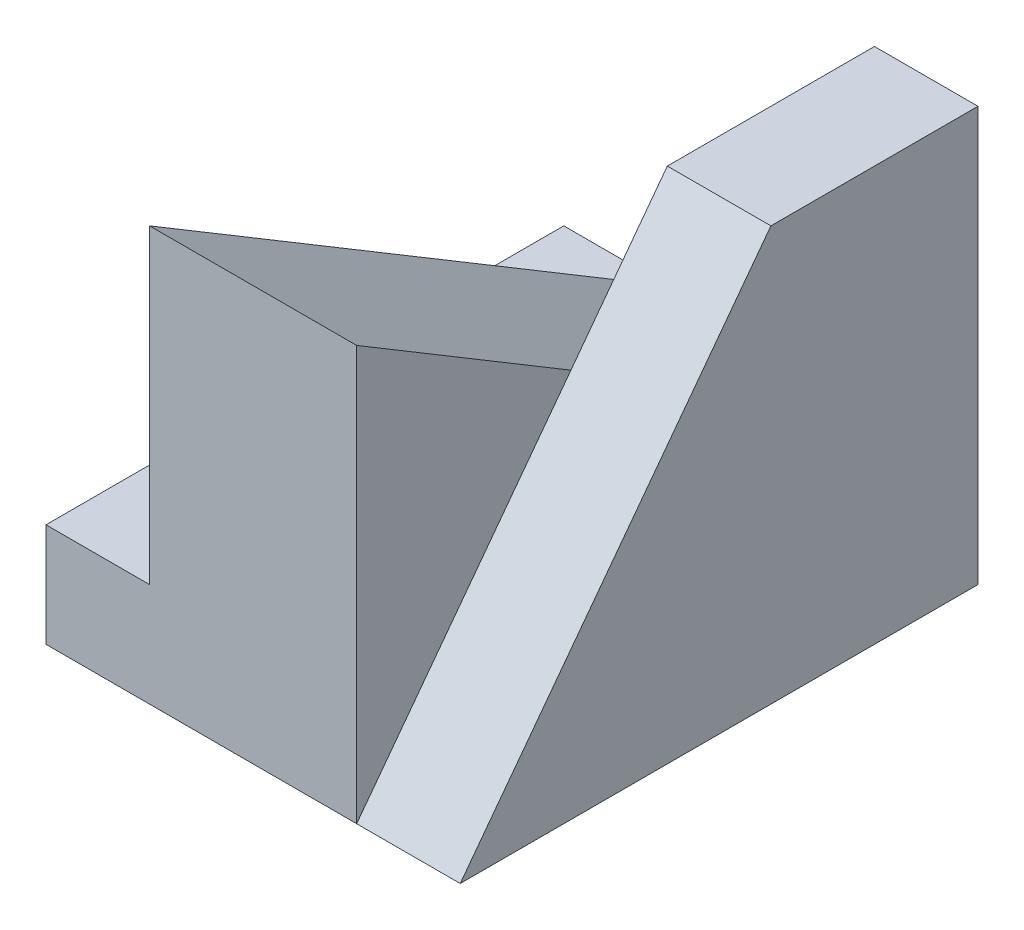
ISO-10303-21;
HEADER;
FILE_DESCRIPTION(('STEP AP214'),'2;1');
FILE_NAME('part.step','',(''),(''),'','','');
FILE_SCHEMA(('AUTOMOTIVE_DESIGN { 1 0 10303 214 1 1 1 1 }'));
ENDSEC;
DATA;
#1=APPLICATION_CONTEXT('core data for automotive mechanical design processes');
#2=APPLICATION_PROTOCOL_DEFINITION('international standard','automotive_design',2000,#1);
#3=PRODUCT_CONTEXT('',#1,'mechanical');
#4=PRODUCT('Part','Part','',(#3));
#5=PRODUCT_RELATED_PRODUCT_CATEGORY('part','',(#4));
#6=PRODUCT_DEFINITION_FORMATION('','',#4);
#7=PRODUCT_DEFINITION_CONTEXT('part definition',#1,'design');
#8=PRODUCT_DEFINITION('design','',#6,#7);
#9=PRODUCT_DEFINITION_SHAPE('','',#8);
#10=(LENGTH_UNIT() NAMED_UNIT(*) SI_UNIT(.MILLI.,.METRE.));
#11=(NAMED_UNIT(*) PLANE_ANGLE_UNIT() SI_UNIT($,.RADIAN.));
#12=(NAMED_UNIT(*) SI_UNIT($,.STERADIAN.) SOLID_ANGLE_UNIT());
#13=UNCERTAINTY_MEASURE_WITH_UNIT(LENGTH_MEASURE(1.E-05),#10,'distance_accuracy_value','');
#14=(GEOMETRIC_REPRESENTATION_CONTEXT(3) GLOBAL_UNCERTAINTY_ASSIGNED_CONTEXT((#13)) GLOBAL_UNIT_ASSIGNED_CONTEXT((#10,
#11,#12)) REPRESENTATION_CONTEXT('',''));
#15=CARTESIAN_POINT('',(0.,0.,0.));
#16=DIRECTION('',(0.,0.,1.));
#17=DIRECTION('',(1.,0.,0.));
#18=AXIS2_PLACEMENT_3D('',#15,#16,#17);
#19=CARTESIAN_POINT('',(0.,0.,0.));
#20=DIRECTION('',(1.,0.,0.));
#21=DIRECTION('',(0.,0.,-1.));
#22=AXIS2_PLACEMENT_3D('',#19,#20,#21);
#23=PLANE('',#22);
#24=DIRECTION('',(0.,-0.514495755427526,-0.857492925712544));
#25=VECTOR('',#24,1.);
#26=CARTESIAN_POINT('',(0.,4.,5.));
#27=LINE('',#26,#25);
#28=CARTESIAN_POINT('',(0.,2.75862068965517,2.93103448275862));
#29=VERTEX_POINT('',#28);
#30=CARTESIAN_POINT('',(0.,1.,0.));
#31=VERTEX_POINT('',#30);
#32=EDGE_CURVE('E11',#29,#31,#27,.T.);
#33=ORIENTED_EDGE('',*,*,#32,.F.);
#34=DIRECTION('',(0.,-0.8,0.6));
#35=VECTOR('',#34,1.);
#36=CARTESIAN_POINT('',(0.,4.,2.));
#37=LINE('',#36,#35);
#38=CARTESIAN_POINT('',(0.,4.,2.));
#39=VERTEX_POINT('',#38);
#40=EDGE_CURVE('E294',#39,#29,#37,.T.);
#41=ORIENTED_EDGE('',*,*,#40,.F.);
#42=DIRECTION('',(0.,0.,1.));
#43=VECTOR('',#42,1.);
#44=CARTESIAN_POINT('',(0.,4.,0.));
#45=LINE('',#44,#43);
#46=CARTESIAN_POINT('',(0.,4.,0.));
#47=VERTEX_POINT('',#46);
#48=EDGE_CURVE('E295',#47,#39,#45,.T.);
#49=ORIENTED_EDGE('',*,*,#48,.F.);
#50=DIRECTION('',(0.,1.,0.));
#51=VECTOR('',#50,1.);
#52=CARTESIAN_POINT('',(0.,0.,0.));
#53=LINE('',#52,#51);
#54=EDGE_CURVE('E163',#31,#47,#53,.T.);
#55=ORIENTED_EDGE('',*,*,#54,.F.);
#56=EDGE_LOOP('',(#33,#41,#49,#55));
#57=FACE_BOUND('',#56,.T.);
#58=ADVANCED_FACE('F33',(#57),#23,.F.);
#59=CARTESIAN_POINT('',(1.,0.,5.));
#60=DIRECTION('',(0.,1.,0.));
#61=DIRECTION('',(0.,0.,1.));
#62=AXIS2_PLACEMENT_3D('',#59,#60,#61);
#63=PLANE('',#62);
#64=DIRECTION('',(-1.,0.,0.));
#65=VECTOR('',#64,1.);
#66=CARTESIAN_POINT('',(1.,0.,5.));
#67=LINE('',#66,#65);
#68=CARTESIAN_POINT('',(1.,0.,5.));
#69=VERTEX_POINT('',#68);
#70=CARTESIAN_POINT('',(0.,0.,5.));
#71=VERTEX_POINT('',#70);
#72=EDGE_CURVE('E300',#69,#71,#67,.T.);
#73=ORIENTED_EDGE('',*,*,#72,.T.);
#74=DIRECTION('',(1.,0.,0.));
#75=VECTOR('',#74,1.);
#76=CARTESIAN_POINT('',(-2.,0.,5.));
#77=LINE('',#76,#75);
#78=CARTESIAN_POINT('',(-3.,0.,5.));
#79=VERTEX_POINT('',#78);
#80=EDGE_CURVE('E119',#79,#71,#77,.T.);
#81=ORIENTED_EDGE('',*,*,#80,.F.);
#82=DIRECTION('',(0.,0.,1.));
#83=VECTOR('',#82,1.);
#84=CARTESIAN_POINT('',(-3.,0.,0.));
#85=LINE('',#84,#83);
#86=CARTESIAN_POINT('',(-3.,0.,0.));
#87=VERTEX_POINT('',#86);
#88=EDGE_CURVE('E116',#87,#79,#85,.T.);
#89=ORIENTED_EDGE('',*,*,#88,.F.);
#90=DIRECTION('',(-1.,0.,0.));
#91=VECTOR('',#90,1.);
#92=CARTESIAN_POINT('',(1.,0.,0.));
#93=LINE('',#92,#91);
#94=CARTESIAN_POINT('',(1.,0.,0.));
#95=VERTEX_POINT('',#94);
#96=EDGE_CURVE('E42',#95,#87,#93,.T.);
#97=ORIENTED_EDGE('',*,*,#96,.F.);
#98=DIRECTION('',(0.,0.,-1.));
#99=VECTOR('',#98,1.);
#100=CARTESIAN_POINT('',(1.,0.,5.));
#101=LINE('',#100,#99);
#102=EDGE_CURVE('E297',#69,#95,#101,.T.);
#103=ORIENTED_EDGE('',*,*,#102,.F.);
#104=EDGE_LOOP('',(#73,#81,#89,#97,#103));
#105=FACE_BOUND('',#104,.T.);
#106=ADVANCED_FACE('F35',(#105),#63,.F.);
#107=CARTESIAN_POINT('',(1.,0.,0.));
#108=DIRECTION('',(0.,0.,1.));
#109=DIRECTION('',(1.,0.,0.));
#110=AXIS2_PLACEMENT_3D('',#107,#108,#109);
#111=PLANE('',#110);
#112=ORIENTED_EDGE('',*,*,#96,.T.);
#113=DIRECTION('',(0.,-1.,0.));
#114=VECTOR('',#113,1.);
#115=CARTESIAN_POINT('',(-3.,1.,0.));
#116=LINE('',#115,#114);
#117=CARTESIAN_POINT('',(-3.,1.,0.));
#118=VERTEX_POINT('',#117);
#119=EDGE_CURVE('E107',#118,#87,#116,.T.);
#120=ORIENTED_EDGE('',*,*,#119,.F.);
#121=DIRECTION('',(1.,0.,0.));
#122=VECTOR('',#121,1.);
#123=CARTESIAN_POINT('',(-3.,1.,0.));
#124=LINE('',#123,#122);
#125=CARTESIAN_POINT('',(-2.,1.,0.));
#126=VERTEX_POINT('',#125);
#127=EDGE_CURVE('E133',#118,#126,#124,.T.);
#128=ORIENTED_EDGE('',*,*,#127,.T.);
#129=DIRECTION('',(1.,0.,0.));
#130=VECTOR('',#129,1.);
#131=CARTESIAN_POINT('',(-2.,1.,0.));
#132=LINE('',#131,#130);
#133=EDGE_CURVE('E165',#126,#31,#132,.T.);
#134=ORIENTED_EDGE('',*,*,#133,.T.);
#135=ORIENTED_EDGE('',*,*,#54,.T.);
#136=DIRECTION('',(-1.,0.,0.));
#137=VECTOR('',#136,1.);
#138=CARTESIAN_POINT('',(1.,4.,0.));
#139=LINE('',#138,#137);
#140=CARTESIAN_POINT('',(1.,4.,0.));
#141=VERTEX_POINT('',#140);
#142=EDGE_CURVE('E113',#141,#47,#139,.T.);
#143=ORIENTED_EDGE('',*,*,#142,.F.);
#144=DIRECTION('',(0.,1.,0.));
#145=VECTOR('',#144,1.);
#146=CARTESIAN_POINT('',(1.,0.,0.));
#147=LINE('',#146,#145);
#148=EDGE_CURVE('E109',#95,#141,#147,.T.);
#149=ORIENTED_EDGE('',*,*,#148,.F.);
#150=EDGE_LOOP('',(#112,#120,#128,#134,#135,#143,#149));
#151=FACE_BOUND('',#150,.T.);
#152=ADVANCED_FACE('F104',(#151),#111,.F.);
#153=CARTESIAN_POINT('',(1.,4.,0.));
#154=DIRECTION('',(0.,-1.,0.));
#155=DIRECTION('',(0.,0.,-1.));
#156=AXIS2_PLACEMENT_3D('',#153,#154,#155);
#157=PLANE('',#156);
#158=ORIENTED_EDGE('',*,*,#48,.T.);
#159=DIRECTION('',(-1.,0.,0.));
#160=VECTOR('',#159,1.);
#161=CARTESIAN_POINT('',(1.,4.,2.));
#162=LINE('',#161,#160);
#163=CARTESIAN_POINT('',(1.,4.,2.));
#164=VERTEX_POINT('',#163);
#165=EDGE_CURVE('E302',#164,#39,#162,.T.);
#166=ORIENTED_EDGE('',*,*,#165,.F.);
#167=DIRECTION('',(0.,0.,1.));
#168=VECTOR('',#167,1.);
#169=CARTESIAN_POINT('',(1.,4.,0.));
#170=LINE('',#169,#168);
#171=EDGE_CURVE('E310',#141,#164,#170,.T.);
#172=ORIENTED_EDGE('',*,*,#171,.F.);
#173=ORIENTED_EDGE('',*,*,#142,.T.);
#174=EDGE_LOOP('',(#158,#166,#172,#173));
#175=FACE_BOUND('',#174,.T.);
#176=ADVANCED_FACE('F194',(#175),#157,.F.);
#177=CARTESIAN_POINT('',(1.,4.,2.));
#178=DIRECTION('',(0.,-0.6,-0.8));
#179=DIRECTION('',(0.,0.8,-0.6));
#180=AXIS2_PLACEMENT_3D('',#177,#178,#179);
#181=PLANE('',#180);
#182=ORIENTED_EDGE('',*,*,#40,.T.);
#183=EDGE_CURVE('E292',#29,#71,#37,.T.);
#184=ORIENTED_EDGE('',*,*,#183,.T.);
#185=ORIENTED_EDGE('',*,*,#72,.F.);
#186=DIRECTION('',(0.,-0.8,0.6));
#187=VECTOR('',#186,1.);
#188=CARTESIAN_POINT('',(1.,4.,2.));
#189=LINE('',#188,#187);
#190=EDGE_CURVE('E303',#164,#69,#189,.T.);
#191=ORIENTED_EDGE('',*,*,#190,.F.);
#192=ORIENTED_EDGE('',*,*,#165,.T.);
#193=EDGE_LOOP('',(#182,#184,#185,#191,#192));
#194=FACE_BOUND('',#193,.T.);
#195=ADVANCED_FACE('F191',(#194),#181,.F.);
#196=CARTESIAN_POINT('',(1.,0.,0.));
#197=DIRECTION('',(1.,0.,0.));
#198=DIRECTION('',(0.,0.,-1.));
#199=AXIS2_PLACEMENT_3D('',#196,#197,#198);
#200=PLANE('',#199);
#201=ORIENTED_EDGE('',*,*,#102,.T.);
#202=ORIENTED_EDGE('',*,*,#148,.T.);
#203=ORIENTED_EDGE('',*,*,#171,.T.);
#204=ORIENTED_EDGE('',*,*,#190,.T.);
#205=EDGE_LOOP('',(#201,#202,#203,#204));
#206=FACE_BOUND('',#205,.T.);
#207=ADVANCED_FACE('F189',(#206),#200,.T.);
#208=CARTESIAN_POINT('',(-2.,0.,5.));
#209=DIRECTION('',(0.,0.,-1.));
#210=DIRECTION('',(-1.,0.,0.));
#211=AXIS2_PLACEMENT_3D('',#208,#209,#210);
#212=PLANE('',#211);
#213=DIRECTION('',(0.,1.,0.));
#214=VECTOR('',#213,1.);
#215=CARTESIAN_POINT('',(0.,0.,5.));
#216=LINE('',#215,#214);
#217=CARTESIAN_POINT('',(0.,4.,5.));
#218=VERTEX_POINT('',#217);
#219=EDGE_CURVE('E149',#71,#218,#216,.T.);
#220=ORIENTED_EDGE('',*,*,#219,.T.);
#221=DIRECTION('',(1.,0.,0.));
#222=VECTOR('',#221,1.);
#223=CARTESIAN_POINT('',(-2.,4.,5.));
#224=LINE('',#223,#222);
#225=CARTESIAN_POINT('',(-2.,4.,5.));
#226=VERTEX_POINT('',#225);
#227=EDGE_CURVE('E160',#226,#218,#224,.T.);
#228=ORIENTED_EDGE('',*,*,#227,.F.);
#229=DIRECTION('',(0.,1.,0.));
#230=VECTOR('',#229,1.);
#231=CARTESIAN_POINT('',(-2.,0.,5.));
#232=LINE('',#231,#230);
#233=CARTESIAN_POINT('',(-2.,1.,5.));
#234=VERTEX_POINT('',#233);
#235=EDGE_CURVE('E141',#234,#226,#232,.T.);
#236=ORIENTED_EDGE('',*,*,#235,.F.);
#237=DIRECTION('',(1.,0.,0.));
#238=VECTOR('',#237,1.);
#239=CARTESIAN_POINT('',(-3.,1.,5.));
#240=LINE('',#239,#238);
#241=CARTESIAN_POINT('',(-3.,1.,5.));
#242=VERTEX_POINT('',#241);
#243=EDGE_CURVE('E135',#242,#234,#240,.T.);
#244=ORIENTED_EDGE('',*,*,#243,.F.);
#245=DIRECTION('',(0.,1.,0.));
#246=VECTOR('',#245,1.);
#247=CARTESIAN_POINT('',(-3.,1.,5.));
#248=LINE('',#247,#246);
#249=EDGE_CURVE('E122',#79,#242,#248,.T.);
#250=ORIENTED_EDGE('',*,*,#249,.F.);
#251=ORIENTED_EDGE('',*,*,#80,.T.);
#252=EDGE_LOOP('',(#220,#228,#236,#244,#250,#251));
#253=FACE_BOUND('',#252,.T.);
#254=ADVANCED_FACE('F219',(#253),#212,.F.);
#255=CARTESIAN_POINT('',(-2.,4.,5.));
#256=DIRECTION('',(0.,-0.857492925712544,0.514495755427526));
#257=DIRECTION('',(0.,-0.514495755427526,-0.857492925712544));
#258=AXIS2_PLACEMENT_3D('',#255,#256,#257);
#259=PLANE('',#258);
#260=EDGE_CURVE('E143',#218,#29,#27,.T.);
#261=ORIENTED_EDGE('',*,*,#260,.T.);
#262=ORIENTED_EDGE('',*,*,#32,.T.);
#263=ORIENTED_EDGE('',*,*,#133,.F.);
#264=DIRECTION('',(0.,-0.514495755427526,-0.857492925712544));
#265=VECTOR('',#264,1.);
#266=CARTESIAN_POINT('',(-2.,4.,5.));
#267=LINE('',#266,#265);
#268=EDGE_CURVE('E138',#226,#126,#267,.T.);
#269=ORIENTED_EDGE('',*,*,#268,.F.);
#270=ORIENTED_EDGE('',*,*,#227,.T.);
#271=EDGE_LOOP('',(#261,#262,#263,#269,#270));
#272=FACE_BOUND('',#271,.T.);
#273=ADVANCED_FACE('F225',(#272),#259,.F.);
#274=CARTESIAN_POINT('',(-2.,0.,0.));
#275=DIRECTION('',(-1.,0.,0.));
#276=DIRECTION('',(0.,0.,1.));
#277=AXIS2_PLACEMENT_3D('',#274,#275,#276);
#278=PLANE('',#277);
#279=DIRECTION('',(0.,0.,-1.));
#280=VECTOR('',#279,1.);
#281=CARTESIAN_POINT('',(-2.,1.,0.));
#282=LINE('',#281,#280);
#283=EDGE_CURVE('E50',#234,#126,#282,.T.);
#284=ORIENTED_EDGE('',*,*,#283,.F.);
#285=ORIENTED_EDGE('',*,*,#235,.T.);
#286=ORIENTED_EDGE('',*,*,#268,.T.);
#287=EDGE_LOOP('',(#284,#285,#286));
#288=FACE_BOUND('',#287,.T.);
#289=ADVANCED_FACE('F168',(#288),#278,.T.);
#290=CARTESIAN_POINT('',(0.,0.,0.));
#291=DIRECTION('',(-1.,0.,0.));
#292=DIRECTION('',(0.,0.,1.));
#293=AXIS2_PLACEMENT_3D('',#290,#291,#292);
#294=PLANE('',#293);
#295=ORIENTED_EDGE('',*,*,#183,.F.);
#296=ORIENTED_EDGE('',*,*,#260,.F.);
#297=ORIENTED_EDGE('',*,*,#219,.F.);
#298=EDGE_LOOP('',(#295,#296,#297));
#299=FACE_BOUND('',#298,.T.);
#300=ADVANCED_FACE('F172',(#299),#294,.F.);
#301=CARTESIAN_POINT('',(-3.,1.,0.));
#302=DIRECTION('',(0.,-1.,0.));
#303=DIRECTION('',(0.,0.,-1.));
#304=AXIS2_PLACEMENT_3D('',#301,#302,#303);
#305=PLANE('',#304);
#306=ORIENTED_EDGE('',*,*,#283,.T.);
#307=ORIENTED_EDGE('',*,*,#127,.F.);
#308=DIRECTION('',(0.,0.,-1.));
#309=VECTOR('',#308,1.);
#310=CARTESIAN_POINT('',(-3.,1.,0.));
#311=LINE('',#310,#309);
#312=EDGE_CURVE('E126',#242,#118,#311,.T.);
#313=ORIENTED_EDGE('',*,*,#312,.F.);
#314=ORIENTED_EDGE('',*,*,#243,.T.);
#315=EDGE_LOOP('',(#306,#307,#313,#314));
#316=FACE_BOUND('',#315,.T.);
#317=ADVANCED_FACE('F170',(#316),#305,.F.);
#318=CARTESIAN_POINT('',(-3.,0.,0.));
#319=DIRECTION('',(-1.,0.,0.));
#320=DIRECTION('',(0.,0.,1.));
#321=AXIS2_PLACEMENT_3D('',#318,#319,#320);
#322=PLANE('',#321);
#323=ORIENTED_EDGE('',*,*,#119,.T.);
#324=ORIENTED_EDGE('',*,*,#88,.T.);
#325=ORIENTED_EDGE('',*,*,#249,.T.);
#326=ORIENTED_EDGE('',*,*,#312,.T.);
#327=EDGE_LOOP('',(#323,#324,#325,#326));
#328=FACE_BOUND('',#327,.T.);
#329=ADVANCED_FACE('F124',(#328),#322,.T.);
#330=CLOSED_SHELL('',(#58,#106,#152,#176,#195,#207,#254,#273,#289,#300,#317,#329));
#331=MANIFOLD_SOLID_BREP('B2',#330);
#332=ADVANCED_BREP_SHAPE_REPRESENTATION('',(#18,#331),#14);
#333=SHAPE_DEFINITION_REPRESENTATION(#9,#332);
ENDSEC;
END-ISO-10303-21;
